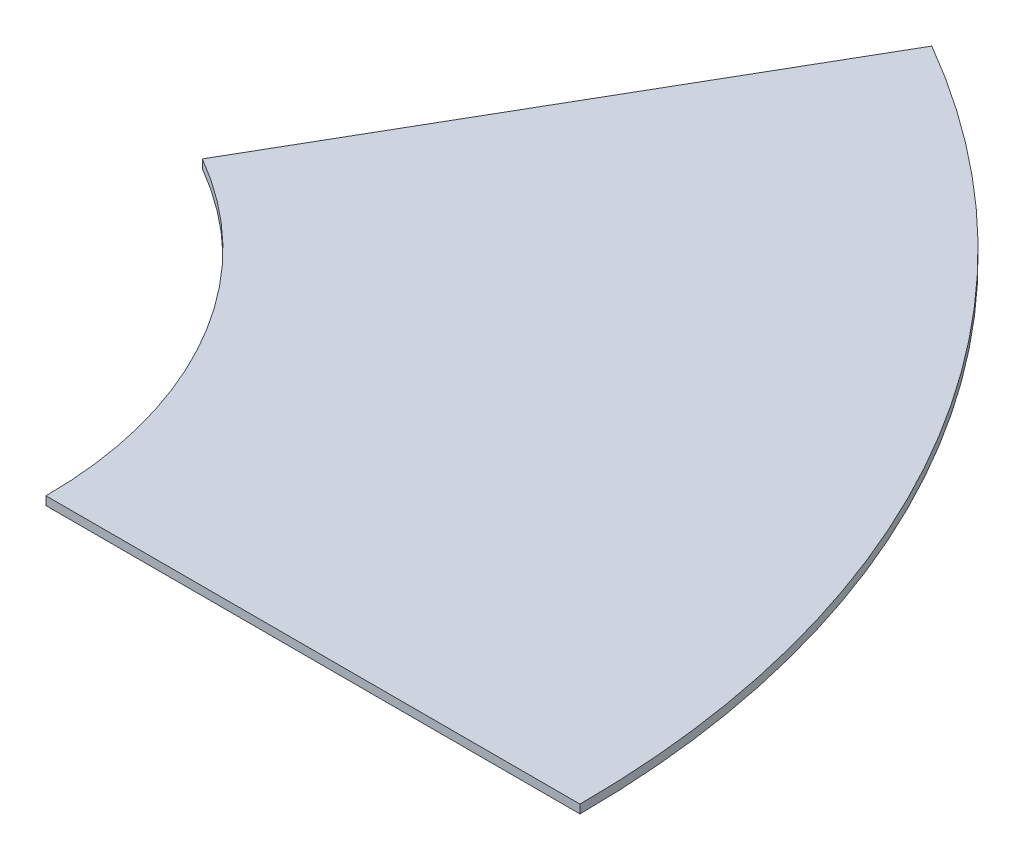
ISO-10303-21;
HEADER;
FILE_DESCRIPTION(('STEP AP214'),'2;1');
FILE_NAME('part.step','',(''),(''),'','','');
FILE_SCHEMA(('AUTOMOTIVE_DESIGN { 1 0 10303 214 1 1 1 1 }'));
ENDSEC;
DATA;
#1=APPLICATION_CONTEXT('core data for automotive mechanical design processes');
#2=APPLICATION_PROTOCOL_DEFINITION('international standard','automotive_design',2000,#1);
#3=PRODUCT_CONTEXT('',#1,'mechanical');
#4=PRODUCT('Part','Part','',(#3));
#5=PRODUCT_RELATED_PRODUCT_CATEGORY('part','',(#4));
#6=PRODUCT_DEFINITION_FORMATION('','',#4);
#7=PRODUCT_DEFINITION_CONTEXT('part definition',#1,'design');
#8=PRODUCT_DEFINITION('design','',#6,#7);
#9=PRODUCT_DEFINITION_SHAPE('','',#8);
#10=(LENGTH_UNIT() NAMED_UNIT(*) SI_UNIT(.MILLI.,.METRE.));
#11=(NAMED_UNIT(*) PLANE_ANGLE_UNIT() SI_UNIT($,.RADIAN.));
#12=(NAMED_UNIT(*) SI_UNIT($,.STERADIAN.) SOLID_ANGLE_UNIT());
#13=UNCERTAINTY_MEASURE_WITH_UNIT(LENGTH_MEASURE(1.E-05),#10,'distance_accuracy_value','');
#14=(GEOMETRIC_REPRESENTATION_CONTEXT(3) GLOBAL_UNCERTAINTY_ASSIGNED_CONTEXT((#13)) GLOBAL_UNIT_ASSIGNED_CONTEXT((#10,
#11,#12)) REPRESENTATION_CONTEXT('',''));
#15=CARTESIAN_POINT('',(0.,0.,0.));
#16=DIRECTION('',(0.,0.,1.));
#17=DIRECTION('',(1.,0.,0.));
#18=AXIS2_PLACEMENT_3D('',#15,#16,#17);
#19=CARTESIAN_POINT('',(0.,-0.2,0.));
#20=DIRECTION('',(0.,1.,0.));
#21=DIRECTION('',(0.,0.,1.));
#22=AXIS2_PLACEMENT_3D('',#19,#20,#21);
#23=CYLINDRICAL_SURFACE('',#22,10.);
#24=CARTESIAN_POINT('',(0.,0.,0.));
#25=DIRECTION('',(0.,-1.,0.));
#26=DIRECTION('',(0.,0.,1.));
#27=AXIS2_PLACEMENT_3D('',#24,#25,#26);
#28=CIRCLE('',#27,10.);
#29=CARTESIAN_POINT('',(4.99999999999998,0.,-8.6602540378444));
#30=VERTEX_POINT('',#29);
#31=CARTESIAN_POINT('',(10.,0.,0.));
#32=VERTEX_POINT('',#31);
#33=EDGE_CURVE('E97',#30,#32,#28,.T.);
#34=ORIENTED_EDGE('',*,*,#33,.F.);
#35=DIRECTION('',(0.,1.,0.));
#36=VECTOR('',#35,1.);
#37=CARTESIAN_POINT('',(4.99999999999998,-0.2,-8.6602540378444));
#38=LINE('',#37,#36);
#39=CARTESIAN_POINT('',(4.99999999999998,-0.2,-8.6602540378444));
#40=VERTEX_POINT('',#39);
#41=EDGE_CURVE('E11',#40,#30,#38,.T.);
#42=ORIENTED_EDGE('',*,*,#41,.F.);
#43=CARTESIAN_POINT('',(0.,-0.2,0.));
#44=DIRECTION('',(0.,-1.,0.));
#45=DIRECTION('',(0.,0.,1.));
#46=AXIS2_PLACEMENT_3D('',#43,#44,#45);
#47=CIRCLE('',#46,10.);
#48=CARTESIAN_POINT('',(10.,-0.2,0.));
#49=VERTEX_POINT('',#48);
#50=EDGE_CURVE('E91',#40,#49,#47,.T.);
#51=ORIENTED_EDGE('',*,*,#50,.T.);
#52=DIRECTION('',(0.,1.,0.));
#53=VECTOR('',#52,1.);
#54=CARTESIAN_POINT('',(10.,-0.2,0.));
#55=LINE('',#54,#53);
#56=EDGE_CURVE('E36',#49,#32,#55,.T.);
#57=ORIENTED_EDGE('',*,*,#56,.T.);
#58=EDGE_LOOP('',(#34,#42,#51,#57));
#59=FACE_BOUND('',#58,.T.);
#60=ADVANCED_FACE('F33',(#59),#23,.F.);
#61=CARTESIAN_POINT('',(11.25,-0.2,-19.4855715851499));
#62=DIRECTION('',(-0.86602540378444,0.,-0.499999999999998));
#63=DIRECTION('',(-0.499999999999998,0.,0.86602540378444));
#64=AXIS2_PLACEMENT_3D('',#61,#62,#63);
#65=PLANE('',#64);
#66=DIRECTION('',(-0.499999999999998,0.,0.86602540378444));
#67=VECTOR('',#66,1.);
#68=CARTESIAN_POINT('',(11.25,0.,-19.4855715851499));
#69=LINE('',#68,#67);
#70=CARTESIAN_POINT('',(11.2499999999999,0.,-19.4855715851499));
#71=VERTEX_POINT('',#70);
#72=EDGE_CURVE('E93',#71,#30,#69,.T.);
#73=ORIENTED_EDGE('',*,*,#72,.F.);
#74=DIRECTION('',(0.,1.,0.));
#75=VECTOR('',#74,1.);
#76=CARTESIAN_POINT('',(11.2499999999999,-0.2,-19.4855715851499));
#77=LINE('',#76,#75);
#78=CARTESIAN_POINT('',(11.2499999999999,-0.2,-19.4855715851499));
#79=VERTEX_POINT('',#78);
#80=EDGE_CURVE('E42',#79,#71,#77,.T.);
#81=ORIENTED_EDGE('',*,*,#80,.F.);
#82=DIRECTION('',(-0.499999999999998,0.,0.86602540378444));
#83=VECTOR('',#82,1.);
#84=CARTESIAN_POINT('',(11.25,-0.2,-19.4855715851499));
#85=LINE('',#84,#83);
#86=EDGE_CURVE('E88',#79,#40,#85,.T.);
#87=ORIENTED_EDGE('',*,*,#86,.T.);
#88=ORIENTED_EDGE('',*,*,#41,.T.);
#89=EDGE_LOOP('',(#73,#81,#87,#88));
#90=FACE_BOUND('',#89,.T.);
#91=ADVANCED_FACE('F107',(#90),#65,.T.);
#92=CARTESIAN_POINT('',(0.,-0.2,0.));
#93=DIRECTION('',(0.,1.,0.));
#94=DIRECTION('',(0.,0.,1.));
#95=AXIS2_PLACEMENT_3D('',#92,#93,#94);
#96=CYLINDRICAL_SURFACE('',#95,22.5);
#97=CARTESIAN_POINT('',(0.,0.,0.));
#98=DIRECTION('',(0.,1.,0.));
#99=DIRECTION('',(0.,0.,1.));
#100=AXIS2_PLACEMENT_3D('',#97,#98,#99);
#101=CIRCLE('',#100,22.5);
#102=CARTESIAN_POINT('',(22.5,0.,0.));
#103=VERTEX_POINT('',#102);
#104=EDGE_CURVE('E83',#103,#71,#101,.T.);
#105=ORIENTED_EDGE('',*,*,#104,.F.);
#106=DIRECTION('',(0.,1.,0.));
#107=VECTOR('',#106,1.);
#108=CARTESIAN_POINT('',(22.5,-0.2,0.));
#109=LINE('',#108,#107);
#110=CARTESIAN_POINT('',(22.5,-0.2,0.));
#111=VERTEX_POINT('',#110);
#112=EDGE_CURVE('E78',#111,#103,#109,.T.);
#113=ORIENTED_EDGE('',*,*,#112,.F.);
#114=CARTESIAN_POINT('',(0.,-0.2,0.));
#115=DIRECTION('',(0.,1.,0.));
#116=DIRECTION('',(0.,0.,1.));
#117=AXIS2_PLACEMENT_3D('',#114,#115,#116);
#118=CIRCLE('',#117,22.5);
#119=EDGE_CURVE('E81',#111,#79,#118,.T.);
#120=ORIENTED_EDGE('',*,*,#119,.T.);
#121=ORIENTED_EDGE('',*,*,#80,.T.);
#122=EDGE_LOOP('',(#105,#113,#120,#121));
#123=FACE_BOUND('',#122,.T.);
#124=ADVANCED_FACE('F80',(#123),#96,.T.);
#125=CARTESIAN_POINT('',(10.,-0.2,0.));
#126=DIRECTION('',(0.,0.,1.));
#127=DIRECTION('',(1.,0.,0.));
#128=AXIS2_PLACEMENT_3D('',#125,#126,#127);
#129=PLANE('',#128);
#130=DIRECTION('',(1.,0.,0.));
#131=VECTOR('',#130,1.);
#132=CARTESIAN_POINT('',(10.,0.,0.));
#133=LINE('',#132,#131);
#134=EDGE_CURVE('E100',#32,#103,#133,.T.);
#135=ORIENTED_EDGE('',*,*,#134,.F.);
#136=ORIENTED_EDGE('',*,*,#56,.F.);
#137=DIRECTION('',(1.,0.,0.));
#138=VECTOR('',#137,1.);
#139=CARTESIAN_POINT('',(10.,-0.2,0.));
#140=LINE('',#139,#138);
#141=EDGE_CURVE('E87',#49,#111,#140,.T.);
#142=ORIENTED_EDGE('',*,*,#141,.T.);
#143=ORIENTED_EDGE('',*,*,#112,.T.);
#144=EDGE_LOOP('',(#135,#136,#142,#143));
#145=FACE_BOUND('',#144,.T.);
#146=ADVANCED_FACE('F90',(#145),#129,.T.);
#147=CARTESIAN_POINT('',(0.,-0.2,0.));
#148=DIRECTION('',(0.,1.,0.));
#149=DIRECTION('',(0.,0.,1.));
#150=AXIS2_PLACEMENT_3D('',#147,#148,#149);
#151=PLANE('',#150);
#152=ORIENTED_EDGE('',*,*,#50,.F.);
#153=ORIENTED_EDGE('',*,*,#86,.F.);
#154=ORIENTED_EDGE('',*,*,#119,.F.);
#155=ORIENTED_EDGE('',*,*,#141,.F.);
#156=EDGE_LOOP('',(#152,#153,#154,#155));
#157=FACE_BOUND('',#156,.T.);
#158=ADVANCED_FACE('F86',(#157),#151,.F.);
#159=CARTESIAN_POINT('',(0.,0.,0.));
#160=DIRECTION('',(0.,1.,0.));
#161=DIRECTION('',(0.,0.,1.));
#162=AXIS2_PLACEMENT_3D('',#159,#160,#161);
#163=PLANE('',#162);
#164=ORIENTED_EDGE('',*,*,#33,.T.);
#165=ORIENTED_EDGE('',*,*,#134,.T.);
#166=ORIENTED_EDGE('',*,*,#104,.T.);
#167=ORIENTED_EDGE('',*,*,#72,.T.);
#168=EDGE_LOOP('',(#164,#165,#166,#167));
#169=FACE_BOUND('',#168,.T.);
#170=ADVANCED_FACE('F106',(#169),#163,.T.);
#171=CLOSED_SHELL('',(#60,#91,#124,#146,#158,#170));
#172=MANIFOLD_SOLID_BREP('B2',#171);
#173=ADVANCED_BREP_SHAPE_REPRESENTATION('',(#18,#172),#14);
#174=SHAPE_DEFINITION_REPRESENTATION(#9,#173);
ENDSEC;
END-ISO-10303-21;
